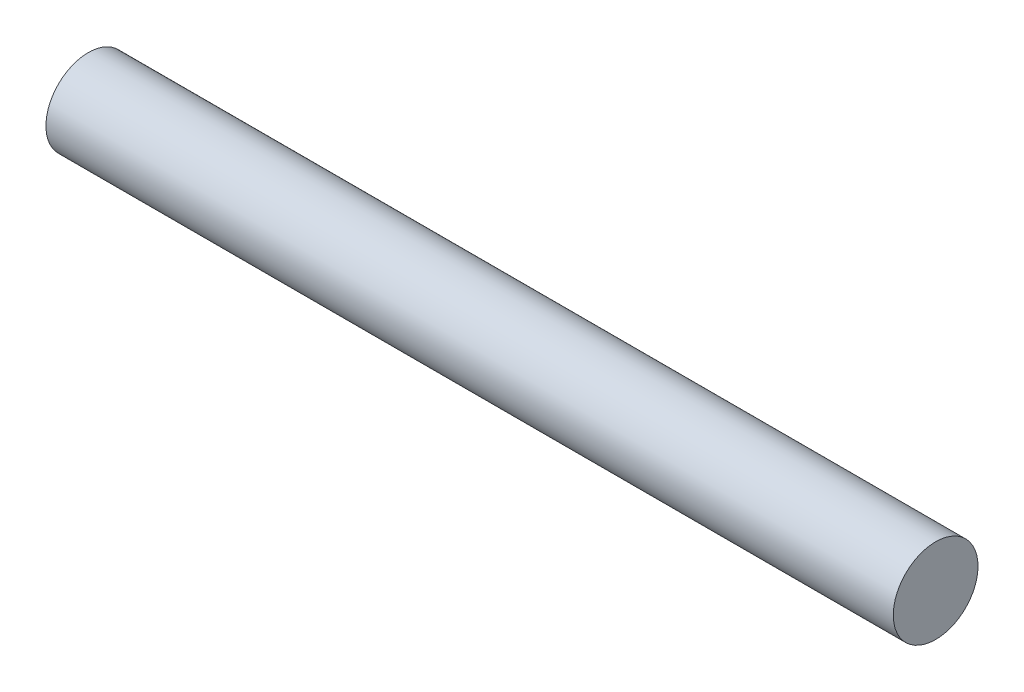
ISO-10303-21;
HEADER;
FILE_DESCRIPTION(('STEP AP214'),'2;1');
FILE_NAME('part.step','',(''),(''),'','','');
FILE_SCHEMA(('AUTOMOTIVE_DESIGN { 1 0 10303 214 1 1 1 1 }'));
ENDSEC;
DATA;
#1=APPLICATION_CONTEXT('core data for automotive mechanical design processes');
#2=APPLICATION_PROTOCOL_DEFINITION('international standard','automotive_design',2000,#1);
#3=PRODUCT_CONTEXT('',#1,'mechanical');
#4=PRODUCT('Part','Part','',(#3));
#5=PRODUCT_RELATED_PRODUCT_CATEGORY('part','',(#4));
#6=PRODUCT_DEFINITION_FORMATION('','',#4);
#7=PRODUCT_DEFINITION_CONTEXT('part definition',#1,'design');
#8=PRODUCT_DEFINITION('design','',#6,#7);
#9=PRODUCT_DEFINITION_SHAPE('','',#8);
#10=(LENGTH_UNIT() NAMED_UNIT(*) SI_UNIT(.MILLI.,.METRE.));
#11=(NAMED_UNIT(*) PLANE_ANGLE_UNIT() SI_UNIT($,.RADIAN.));
#12=(NAMED_UNIT(*) SI_UNIT($,.STERADIAN.) SOLID_ANGLE_UNIT());
#13=UNCERTAINTY_MEASURE_WITH_UNIT(LENGTH_MEASURE(1.E-05),#10,'distance_accuracy_value','');
#14=(GEOMETRIC_REPRESENTATION_CONTEXT(3) GLOBAL_UNCERTAINTY_ASSIGNED_CONTEXT((#13)) GLOBAL_UNIT_ASSIGNED_CONTEXT((#10,
#11,#12)) REPRESENTATION_CONTEXT('',''));
#15=CARTESIAN_POINT('',(0.,0.,0.));
#16=DIRECTION('',(0.,0.,1.));
#17=DIRECTION('',(1.,0.,0.));
#18=AXIS2_PLACEMENT_3D('',#15,#16,#17);
#19=CARTESIAN_POINT('',(300.,0.,0.));
#20=DIRECTION('',(-1.,0.,0.));
#21=DIRECTION('',(0.,0.,1.));
#22=AXIS2_PLACEMENT_3D('',#19,#20,#21);
#23=CYLINDRICAL_SURFACE('',#22,15.);
#24=CARTESIAN_POINT('',(300.,0.,0.));
#25=DIRECTION('',(1.,0.,0.));
#26=DIRECTION('',(0.,0.,-1.));
#27=AXIS2_PLACEMENT_3D('',#24,#25,#26);
#28=CIRCLE('',#27,15.);
#29=CARTESIAN_POINT('',(300.,0.,-15.));
#30=VERTEX_POINT('',#29);
#31=EDGE_CURVE('E10',#30,#30,#28,.T.);
#32=ORIENTED_EDGE('',*,*,#31,.F.);
#33=EDGE_LOOP('',(#32));
#34=FACE_BOUND('',#33,.T.);
#35=CARTESIAN_POINT('',(0.,0.,0.));
#36=DIRECTION('',(1.,0.,0.));
#37=DIRECTION('',(0.,0.,-1.));
#38=AXIS2_PLACEMENT_3D('',#35,#36,#37);
#39=CIRCLE('',#38,15.);
#40=CARTESIAN_POINT('',(0.,0.,-15.));
#41=VERTEX_POINT('',#40);
#42=EDGE_CURVE('E40',#41,#41,#39,.T.);
#43=ORIENTED_EDGE('',*,*,#42,.T.);
#44=EDGE_LOOP('',(#43));
#45=FACE_BOUND('',#44,.T.);
#46=ADVANCED_FACE('F37',(#34,#45),#23,.T.);
#47=CARTESIAN_POINT('',(300.,0.,0.));
#48=DIRECTION('',(1.,0.,0.));
#49=DIRECTION('',(0.,0.,-1.));
#50=AXIS2_PLACEMENT_3D('',#47,#48,#49);
#51=PLANE('',#50);
#52=ORIENTED_EDGE('',*,*,#31,.T.);
#53=EDGE_LOOP('',(#52));
#54=FACE_BOUND('',#53,.T.);
#55=ADVANCED_FACE('F54',(#54),#51,.T.);
#56=CARTESIAN_POINT('',(0.,0.,0.));
#57=DIRECTION('',(1.,0.,0.));
#58=DIRECTION('',(0.,0.,-1.));
#59=AXIS2_PLACEMENT_3D('',#56,#57,#58);
#60=PLANE('',#59);
#61=ORIENTED_EDGE('',*,*,#42,.F.);
#62=EDGE_LOOP('',(#61));
#63=FACE_BOUND('',#62,.T.);
#64=ADVANCED_FACE('F52',(#63),#60,.F.);
#65=CLOSED_SHELL('',(#46,#55,#64));
#66=MANIFOLD_SOLID_BREP('B2',#65);
#67=ADVANCED_BREP_SHAPE_REPRESENTATION('',(#18,#66),#14);
#68=SHAPE_DEFINITION_REPRESENTATION(#9,#67);
ENDSEC;
END-ISO-10303-21;
